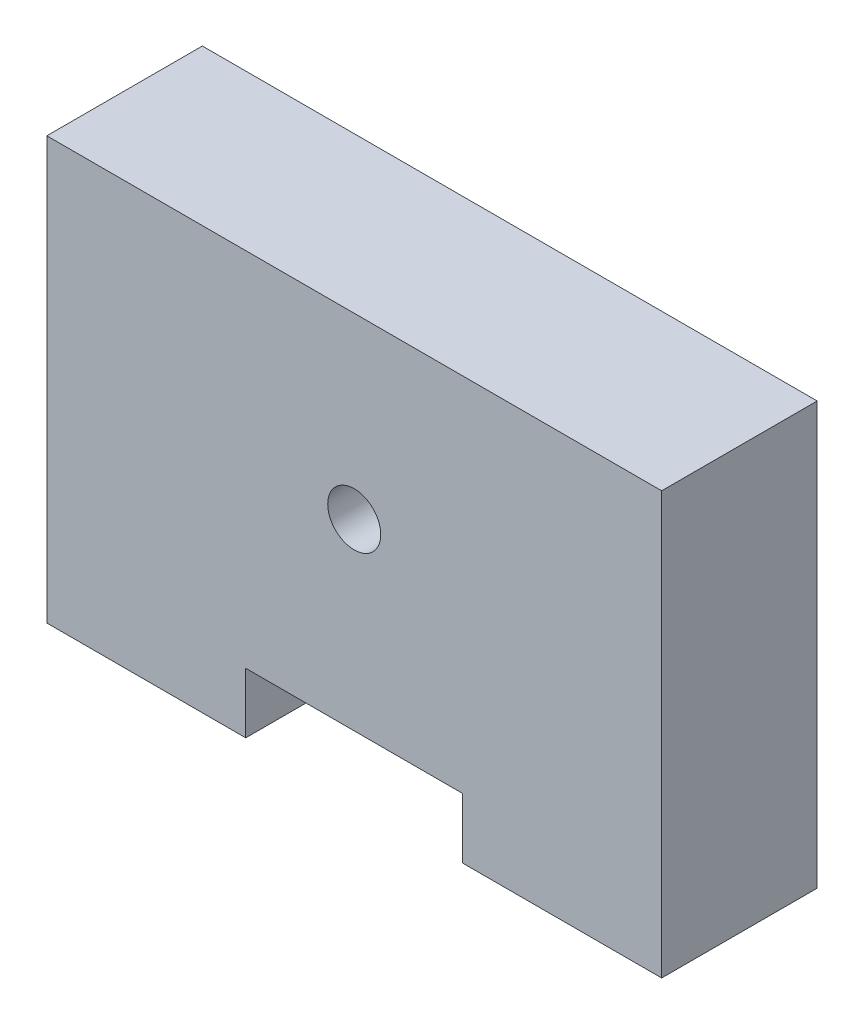
ISO-10303-21;
HEADER;
FILE_DESCRIPTION(('STEP AP214'),'2;1');
FILE_NAME('part.step','',(''),(''),'','','');
FILE_SCHEMA(('AUTOMOTIVE_DESIGN { 1 0 10303 214 1 1 1 1 }'));
ENDSEC;
DATA;
#1=APPLICATION_CONTEXT('core data for automotive mechanical design processes');
#2=APPLICATION_PROTOCOL_DEFINITION('international standard','automotive_design',2000,#1);
#3=PRODUCT_CONTEXT('',#1,'mechanical');
#4=PRODUCT('Part','Part','',(#3));
#5=PRODUCT_RELATED_PRODUCT_CATEGORY('part','',(#4));
#6=PRODUCT_DEFINITION_FORMATION('','',#4);
#7=PRODUCT_DEFINITION_CONTEXT('part definition',#1,'design');
#8=PRODUCT_DEFINITION('design','',#6,#7);
#9=PRODUCT_DEFINITION_SHAPE('','',#8);
#10=(LENGTH_UNIT() NAMED_UNIT(*) SI_UNIT(.MILLI.,.METRE.));
#11=(NAMED_UNIT(*) PLANE_ANGLE_UNIT() SI_UNIT($,.RADIAN.));
#12=(NAMED_UNIT(*) SI_UNIT($,.STERADIAN.) SOLID_ANGLE_UNIT());
#13=UNCERTAINTY_MEASURE_WITH_UNIT(LENGTH_MEASURE(1.E-05),#10,'distance_accuracy_value','');
#14=(GEOMETRIC_REPRESENTATION_CONTEXT(3) GLOBAL_UNCERTAINTY_ASSIGNED_CONTEXT((#13)) GLOBAL_UNIT_ASSIGNED_CONTEXT((#10,
#11,#12)) REPRESENTATION_CONTEXT('',''));
#15=CARTESIAN_POINT('',(0.,0.,0.));
#16=DIRECTION('',(0.,0.,1.));
#17=DIRECTION('',(1.,0.,0.));
#18=AXIS2_PLACEMENT_3D('',#15,#16,#17);
#19=CARTESIAN_POINT('',(0.,0.,0.));
#20=DIRECTION('',(0.,-1.,0.));
#21=DIRECTION('',(0.,0.,-1.));
#22=AXIS2_PLACEMENT_3D('',#19,#20,#21);
#23=PLANE('',#22);
#24=DIRECTION('',(0.,0.,-1.));
#25=VECTOR('',#24,1.);
#26=CARTESIAN_POINT('',(9.,0.,25.1315416922694));
#27=LINE('',#26,#25);
#28=CARTESIAN_POINT('',(9.,0.,6.45));
#29=VERTEX_POINT('',#28);
#30=CARTESIAN_POINT('',(9.,0.,-6.45));
#31=VERTEX_POINT('',#30);
#32=EDGE_CURVE('E128',#29,#31,#27,.T.);
#33=ORIENTED_EDGE('',*,*,#32,.T.);
#34=DIRECTION('',(-1.,0.,0.));
#35=VECTOR('',#34,1.);
#36=CARTESIAN_POINT('',(25.5,0.,-6.45000000000001));
#37=LINE('',#36,#35);
#38=CARTESIAN_POINT('',(25.5,0.,-6.45000000000001));
#39=VERTEX_POINT('',#38);
#40=EDGE_CURVE('E140',#39,#31,#37,.T.);
#41=ORIENTED_EDGE('',*,*,#40,.F.);
#42=DIRECTION('',(0.,0.,-1.));
#43=VECTOR('',#42,1.);
#44=CARTESIAN_POINT('',(25.5,0.,-6.45000000000001));
#45=LINE('',#44,#43);
#46=CARTESIAN_POINT('',(25.5,0.,6.45000000000001));
#47=VERTEX_POINT('',#46);
#48=EDGE_CURVE('E151',#47,#39,#45,.T.);
#49=ORIENTED_EDGE('',*,*,#48,.F.);
#50=DIRECTION('',(1.,0.,0.));
#51=VECTOR('',#50,1.);
#52=CARTESIAN_POINT('',(25.5,0.,6.45000000000001));
#53=LINE('',#52,#51);
#54=EDGE_CURVE('E90',#29,#47,#53,.T.);
#55=ORIENTED_EDGE('',*,*,#54,.F.);
#56=EDGE_LOOP('',(#33,#41,#49,#55));
#57=FACE_BOUND('',#56,.T.);
#58=CARTESIAN_POINT('',(18.75,0.,0.));
#59=DIRECTION('',(0.,-1.,0.));
#60=DIRECTION('',(0.,0.,-1.));
#61=AXIS2_PLACEMENT_3D('',#58,#59,#60);
#62=CIRCLE('',#61,1.25);
#63=CARTESIAN_POINT('',(18.75,0.,-1.25));
#64=VERTEX_POINT('',#63);
#65=EDGE_CURVE('E191',#64,#64,#62,.T.);
#66=ORIENTED_EDGE('',*,*,#65,.F.);
#67=EDGE_LOOP('',(#66));
#68=FACE_BOUND('',#67,.T.);
#69=ADVANCED_FACE('F45',(#57,#68),#23,.T.);
#70=CARTESIAN_POINT('',(25.5,35.,-6.45000000000001));
#71=DIRECTION('',(-1.,0.,0.));
#72=DIRECTION('',(0.,0.,1.));
#73=AXIS2_PLACEMENT_3D('',#70,#71,#72);
#74=PLANE('',#73);
#75=ORIENTED_EDGE('',*,*,#48,.T.);
#76=DIRECTION('',(0.,-1.,0.));
#77=VECTOR('',#76,1.);
#78=CARTESIAN_POINT('',(25.5,35.,-6.45000000000001));
#79=LINE('',#78,#77);
#80=CARTESIAN_POINT('',(25.5,35.,-6.45000000000001));
#81=VERTEX_POINT('',#80);
#82=EDGE_CURVE('E11',#81,#39,#79,.T.);
#83=ORIENTED_EDGE('',*,*,#82,.F.);
#84=DIRECTION('',(0.,0.,-1.));
#85=VECTOR('',#84,1.);
#86=CARTESIAN_POINT('',(25.5,35.,-6.45000000000001));
#87=LINE('',#86,#85);
#88=CARTESIAN_POINT('',(25.5,35.,6.45000000000001));
#89=VERTEX_POINT('',#88);
#90=EDGE_CURVE('E158',#89,#81,#87,.T.);
#91=ORIENTED_EDGE('',*,*,#90,.F.);
#92=DIRECTION('',(0.,-1.,0.));
#93=VECTOR('',#92,1.);
#94=CARTESIAN_POINT('',(25.5,35.,6.45000000000001));
#95=LINE('',#94,#93);
#96=EDGE_CURVE('E159',#89,#47,#95,.T.);
#97=ORIENTED_EDGE('',*,*,#96,.T.);
#98=EDGE_LOOP('',(#75,#83,#91,#97));
#99=FACE_BOUND('',#98,.T.);
#100=ADVANCED_FACE('F47',(#99),#74,.F.);
#101=CARTESIAN_POINT('',(25.5,35.,-6.45000000000001));
#102=DIRECTION('',(0.,0.,1.));
#103=DIRECTION('',(1.,0.,0.));
#104=AXIS2_PLACEMENT_3D('',#101,#102,#103);
#105=PLANE('',#104);
#106=CARTESIAN_POINT('',(0.,20.2,-6.45));
#107=DIRECTION('',(0.,0.,-1.));
#108=DIRECTION('',(-1.,0.,0.));
#109=AXIS2_PLACEMENT_3D('',#106,#107,#108);
#110=CIRCLE('',#109,2.2);
#111=CARTESIAN_POINT('',(-2.2,20.2,-6.45));
#112=VERTEX_POINT('',#111);
#113=EDGE_CURVE('E135',#112,#112,#110,.T.);
#114=ORIENTED_EDGE('',*,*,#113,.F.);
#115=EDGE_LOOP('',(#114));
#116=FACE_BOUND('',#115,.T.);
#117=ORIENTED_EDGE('',*,*,#40,.T.);
#118=DIRECTION('',(0.,-1.,0.));
#119=VECTOR('',#118,1.);
#120=CARTESIAN_POINT('',(9.,0.,-6.45));
#121=LINE('',#120,#119);
#122=CARTESIAN_POINT('',(9.,5.,-6.45));
#123=VERTEX_POINT('',#122);
#124=EDGE_CURVE('E125',#123,#31,#121,.T.);
#125=ORIENTED_EDGE('',*,*,#124,.F.);
#126=DIRECTION('',(1.,0.,0.));
#127=VECTOR('',#126,1.);
#128=CARTESIAN_POINT('',(9.,5.,-6.45));
#129=LINE('',#128,#127);
#130=CARTESIAN_POINT('',(-9.,5.,-6.45));
#131=VERTEX_POINT('',#130);
#132=EDGE_CURVE('E142',#131,#123,#129,.T.);
#133=ORIENTED_EDGE('',*,*,#132,.F.);
#134=DIRECTION('',(0.,1.,0.));
#135=VECTOR('',#134,1.);
#136=CARTESIAN_POINT('',(-9.,0.,-6.45));
#137=LINE('',#136,#135);
#138=CARTESIAN_POINT('',(-9.,0.,-6.45));
#139=VERTEX_POINT('',#138);
#140=EDGE_CURVE('E134',#139,#131,#137,.T.);
#141=ORIENTED_EDGE('',*,*,#140,.F.);
#142=CARTESIAN_POINT('',(-25.5,0.,-6.45));
#143=VERTEX_POINT('',#142);
#144=EDGE_CURVE('E148',#139,#143,#37,.T.);
#145=ORIENTED_EDGE('',*,*,#144,.T.);
#146=DIRECTION('',(0.,-1.,0.));
#147=VECTOR('',#146,1.);
#148=CARTESIAN_POINT('',(-25.5,35.,-6.45));
#149=LINE('',#148,#147);
#150=CARTESIAN_POINT('',(-25.5,35.,-6.45));
#151=VERTEX_POINT('',#150);
#152=EDGE_CURVE('E53',#151,#143,#149,.T.);
#153=ORIENTED_EDGE('',*,*,#152,.F.);
#154=DIRECTION('',(-1.,0.,0.));
#155=VECTOR('',#154,1.);
#156=CARTESIAN_POINT('',(25.5,35.,-6.45000000000001));
#157=LINE('',#156,#155);
#158=EDGE_CURVE('E97',#81,#151,#157,.T.);
#159=ORIENTED_EDGE('',*,*,#158,.F.);
#160=ORIENTED_EDGE('',*,*,#82,.T.);
#161=EDGE_LOOP('',(#117,#125,#133,#141,#145,#153,#159,#160));
#162=FACE_BOUND('',#161,.T.);
#163=ADVANCED_FACE('F144',(#116,#162),#105,.F.);
#164=CARTESIAN_POINT('',(-25.5,35.,-6.45));
#165=DIRECTION('',(1.,0.,0.));
#166=DIRECTION('',(0.,0.,-1.));
#167=AXIS2_PLACEMENT_3D('',#164,#165,#166);
#168=PLANE('',#167);
#169=DIRECTION('',(0.,0.,1.));
#170=VECTOR('',#169,1.);
#171=CARTESIAN_POINT('',(-25.5,0.,-6.45));
#172=LINE('',#171,#170);
#173=CARTESIAN_POINT('',(-25.5,0.,6.45));
#174=VERTEX_POINT('',#173);
#175=EDGE_CURVE('E147',#143,#174,#172,.T.);
#176=ORIENTED_EDGE('',*,*,#175,.T.);
#177=DIRECTION('',(0.,-1.,0.));
#178=VECTOR('',#177,1.);
#179=CARTESIAN_POINT('',(-25.5,35.,6.45));
#180=LINE('',#179,#178);
#181=CARTESIAN_POINT('',(-25.5,35.,6.45));
#182=VERTEX_POINT('',#181);
#183=EDGE_CURVE('E161',#182,#174,#180,.T.);
#184=ORIENTED_EDGE('',*,*,#183,.F.);
#185=DIRECTION('',(0.,0.,1.));
#186=VECTOR('',#185,1.);
#187=CARTESIAN_POINT('',(-25.5,35.,-6.45));
#188=LINE('',#187,#186);
#189=EDGE_CURVE('E169',#151,#182,#188,.T.);
#190=ORIENTED_EDGE('',*,*,#189,.F.);
#191=ORIENTED_EDGE('',*,*,#152,.T.);
#192=EDGE_LOOP('',(#176,#184,#190,#191));
#193=FACE_BOUND('',#192,.T.);
#194=ADVANCED_FACE('F167',(#193),#168,.F.);
#195=CARTESIAN_POINT('',(25.5,35.,6.45000000000001));
#196=DIRECTION('',(0.,0.,-1.));
#197=DIRECTION('',(-1.,0.,0.));
#198=AXIS2_PLACEMENT_3D('',#195,#196,#197);
#199=PLANE('',#198);
#200=CARTESIAN_POINT('',(0.,20.2,6.45));
#201=DIRECTION('',(0.,0.,-1.));
#202=DIRECTION('',(-1.,0.,0.));
#203=AXIS2_PLACEMENT_3D('',#200,#201,#202);
#204=CIRCLE('',#203,2.2);
#205=CARTESIAN_POINT('',(-2.2,20.2,6.45));
#206=VERTEX_POINT('',#205);
#207=EDGE_CURVE('E197',#206,#206,#204,.F.);
#208=ORIENTED_EDGE('',*,*,#207,.F.);
#209=EDGE_LOOP('',(#208));
#210=FACE_BOUND('',#209,.T.);
#211=DIRECTION('',(-1.,0.,0.));
#212=VECTOR('',#211,1.);
#213=CARTESIAN_POINT('',(9.00000000000001,5.,6.45));
#214=LINE('',#213,#212);
#215=CARTESIAN_POINT('',(9.,5.,6.45));
#216=VERTEX_POINT('',#215);
#217=CARTESIAN_POINT('',(-9.,5.,6.45));
#218=VERTEX_POINT('',#217);
#219=EDGE_CURVE('E208',#216,#218,#214,.T.);
#220=ORIENTED_EDGE('',*,*,#219,.F.);
#221=DIRECTION('',(0.,1.,0.));
#222=VECTOR('',#221,1.);
#223=CARTESIAN_POINT('',(9.,0.,6.45));
#224=LINE('',#223,#222);
#225=EDGE_CURVE('E194',#29,#216,#224,.T.);
#226=ORIENTED_EDGE('',*,*,#225,.F.);
#227=ORIENTED_EDGE('',*,*,#54,.T.);
#228=ORIENTED_EDGE('',*,*,#96,.F.);
#229=DIRECTION('',(1.,0.,0.));
#230=VECTOR('',#229,1.);
#231=CARTESIAN_POINT('',(25.5,35.,6.45000000000001));
#232=LINE('',#231,#230);
#233=EDGE_CURVE('E69',#182,#89,#232,.T.);
#234=ORIENTED_EDGE('',*,*,#233,.F.);
#235=ORIENTED_EDGE('',*,*,#183,.T.);
#236=CARTESIAN_POINT('',(-9.,0.,6.45));
#237=VERTEX_POINT('',#236);
#238=EDGE_CURVE('E155',#174,#237,#53,.T.);
#239=ORIENTED_EDGE('',*,*,#238,.T.);
#240=DIRECTION('',(0.,-1.,0.));
#241=VECTOR('',#240,1.);
#242=CARTESIAN_POINT('',(-9.,0.,6.45));
#243=LINE('',#242,#241);
#244=EDGE_CURVE('E60',#218,#237,#243,.T.);
#245=ORIENTED_EDGE('',*,*,#244,.F.);
#246=EDGE_LOOP('',(#220,#226,#227,#228,#234,#235,#239,#245));
#247=FACE_BOUND('',#246,.T.);
#248=ADVANCED_FACE('F176',(#210,#247),#199,.F.);
#249=CARTESIAN_POINT('',(0.,35.,0.));
#250=DIRECTION('',(0.,-1.,0.));
#251=DIRECTION('',(0.,0.,-1.));
#252=AXIS2_PLACEMENT_3D('',#249,#250,#251);
#253=PLANE('',#252);
#254=ORIENTED_EDGE('',*,*,#90,.T.);
#255=ORIENTED_EDGE('',*,*,#158,.T.);
#256=ORIENTED_EDGE('',*,*,#189,.T.);
#257=ORIENTED_EDGE('',*,*,#233,.T.);
#258=EDGE_LOOP('',(#254,#255,#256,#257));
#259=FACE_BOUND('',#258,.T.);
#260=ADVANCED_FACE('F235',(#259),#253,.F.);
#261=DIRECTION('',(0.,0.,-1.));
#262=VECTOR('',#261,1.);
#263=CARTESIAN_POINT('',(-9.,0.,25.1315416922694));
#264=LINE('',#263,#262);
#265=EDGE_CURVE('E141',#237,#139,#264,.T.);
#266=ORIENTED_EDGE('',*,*,#265,.F.);
#267=ORIENTED_EDGE('',*,*,#238,.F.);
#268=ORIENTED_EDGE('',*,*,#175,.F.);
#269=ORIENTED_EDGE('',*,*,#144,.F.);
#270=EDGE_LOOP('',(#266,#267,#268,#269));
#271=FACE_BOUND('',#270,.T.);
#272=CARTESIAN_POINT('',(-18.75,0.,0.));
#273=DIRECTION('',(0.,-1.,0.));
#274=DIRECTION('',(0.,0.,-1.));
#275=AXIS2_PLACEMENT_3D('',#272,#273,#274);
#276=CIRCLE('',#275,1.25);
#277=CARTESIAN_POINT('',(-18.75,0.,-1.25));
#278=VERTEX_POINT('',#277);
#279=EDGE_CURVE('E185',#278,#278,#276,.T.);
#280=ORIENTED_EDGE('',*,*,#279,.F.);
#281=EDGE_LOOP('',(#280));
#282=FACE_BOUND('',#281,.T.);
#283=ADVANCED_FACE('F173',(#271,#282),#23,.T.);
#284=CARTESIAN_POINT('',(-18.75,16.,0.));
#285=DIRECTION('',(0.,-1.,0.));
#286=DIRECTION('',(0.,0.,-1.));
#287=AXIS2_PLACEMENT_3D('',#284,#285,#286);
#288=CONICAL_SURFACE('',#287,1.25,1.02974425867665);
#289=CARTESIAN_POINT('',(-18.75,16.7510757737845,0.));
#290=VERTEX_POINT('',#289);
#291=VERTEX_LOOP('',#290);
#292=FACE_BOUND('',#291,.T.);
#293=CARTESIAN_POINT('',(-18.75,16.,0.));
#294=DIRECTION('',(0.,-1.,0.));
#295=DIRECTION('',(0.,0.,-1.));
#296=AXIS2_PLACEMENT_3D('',#293,#294,#295);
#297=CIRCLE('',#296,1.25);
#298=CARTESIAN_POINT('',(-18.75,16.,-1.25));
#299=VERTEX_POINT('',#298);
#300=EDGE_CURVE('E182',#299,#299,#297,.T.);
#301=ORIENTED_EDGE('',*,*,#300,.T.);
#302=EDGE_LOOP('',(#301));
#303=FACE_BOUND('',#302,.T.);
#304=ADVANCED_FACE('F234',(#292,#303),#288,.F.);
#305=CARTESIAN_POINT('',(-18.75,0.,0.));
#306=DIRECTION('',(0.,-1.,0.));
#307=DIRECTION('',(0.,0.,-1.));
#308=AXIS2_PLACEMENT_3D('',#305,#306,#307);
#309=CYLINDRICAL_SURFACE('',#308,1.25);
#310=ORIENTED_EDGE('',*,*,#300,.F.);
#311=EDGE_LOOP('',(#310));
#312=FACE_BOUND('',#311,.T.);
#313=ORIENTED_EDGE('',*,*,#279,.T.);
#314=EDGE_LOOP('',(#313));
#315=FACE_BOUND('',#314,.T.);
#316=ADVANCED_FACE('F240',(#312,#315),#309,.F.);
#317=CARTESIAN_POINT('',(18.75,16.,0.));
#318=DIRECTION('',(0.,-1.,0.));
#319=DIRECTION('',(0.,0.,-1.));
#320=AXIS2_PLACEMENT_3D('',#317,#318,#319);
#321=CONICAL_SURFACE('',#320,1.25,1.02974425867665);
#322=CARTESIAN_POINT('',(18.75,16.7510757737845,0.));
#323=VERTEX_POINT('',#322);
#324=VERTEX_LOOP('',#323);
#325=FACE_BOUND('',#324,.T.);
#326=CARTESIAN_POINT('',(18.75,16.,0.));
#327=DIRECTION('',(0.,-1.,0.));
#328=DIRECTION('',(0.,0.,-1.));
#329=AXIS2_PLACEMENT_3D('',#326,#327,#328);
#330=CIRCLE('',#329,1.25);
#331=CARTESIAN_POINT('',(18.75,16.,-1.25));
#332=VERTEX_POINT('',#331);
#333=EDGE_CURVE('E188',#332,#332,#330,.T.);
#334=ORIENTED_EDGE('',*,*,#333,.T.);
#335=EDGE_LOOP('',(#334));
#336=FACE_BOUND('',#335,.T.);
#337=ADVANCED_FACE('F250',(#325,#336),#321,.F.);
#338=CARTESIAN_POINT('',(18.75,0.,0.));
#339=DIRECTION('',(0.,-1.,0.));
#340=DIRECTION('',(0.,0.,-1.));
#341=AXIS2_PLACEMENT_3D('',#338,#339,#340);
#342=CYLINDRICAL_SURFACE('',#341,1.25);
#343=ORIENTED_EDGE('',*,*,#333,.F.);
#344=EDGE_LOOP('',(#343));
#345=FACE_BOUND('',#344,.T.);
#346=ORIENTED_EDGE('',*,*,#65,.T.);
#347=EDGE_LOOP('',(#346));
#348=FACE_BOUND('',#347,.T.);
#349=ADVANCED_FACE('F254',(#345,#348),#342,.F.);
#350=CARTESIAN_POINT('',(9.,0.,25.1315416922694));
#351=DIRECTION('',(1.,0.,0.));
#352=DIRECTION('',(0.,0.,-1.));
#353=AXIS2_PLACEMENT_3D('',#350,#351,#352);
#354=PLANE('',#353);
#355=ORIENTED_EDGE('',*,*,#225,.T.);
#356=DIRECTION('',(0.,0.,-1.));
#357=VECTOR('',#356,1.);
#358=CARTESIAN_POINT('',(9.,5.,25.1315416922694));
#359=LINE('',#358,#357);
#360=EDGE_CURVE('E130',#216,#123,#359,.T.);
#361=ORIENTED_EDGE('',*,*,#360,.T.);
#362=ORIENTED_EDGE('',*,*,#124,.T.);
#363=ORIENTED_EDGE('',*,*,#32,.F.);
#364=EDGE_LOOP('',(#355,#361,#362,#363));
#365=FACE_BOUND('',#364,.T.);
#366=ADVANCED_FACE('F127',(#365),#354,.F.);
#367=CARTESIAN_POINT('',(9.,5.,25.1315416922694));
#368=DIRECTION('',(0.,1.,0.));
#369=DIRECTION('',(0.,0.,1.));
#370=AXIS2_PLACEMENT_3D('',#367,#368,#369);
#371=PLANE('',#370);
#372=ORIENTED_EDGE('',*,*,#219,.T.);
#373=DIRECTION('',(0.,0.,-1.));
#374=VECTOR('',#373,1.);
#375=CARTESIAN_POINT('',(-9.,5.,25.1315416922694));
#376=LINE('',#375,#374);
#377=EDGE_CURVE('E201',#218,#131,#376,.T.);
#378=ORIENTED_EDGE('',*,*,#377,.T.);
#379=ORIENTED_EDGE('',*,*,#132,.T.);
#380=ORIENTED_EDGE('',*,*,#360,.F.);
#381=EDGE_LOOP('',(#372,#378,#379,#380));
#382=FACE_BOUND('',#381,.T.);
#383=ADVANCED_FACE('F211',(#382),#371,.F.);
#384=CARTESIAN_POINT('',(-9.,0.,25.1315416922694));
#385=DIRECTION('',(-1.,0.,0.));
#386=DIRECTION('',(0.,0.,1.));
#387=AXIS2_PLACEMENT_3D('',#384,#385,#386);
#388=PLANE('',#387);
#389=ORIENTED_EDGE('',*,*,#244,.T.);
#390=ORIENTED_EDGE('',*,*,#265,.T.);
#391=ORIENTED_EDGE('',*,*,#140,.T.);
#392=ORIENTED_EDGE('',*,*,#377,.F.);
#393=EDGE_LOOP('',(#389,#390,#391,#392));
#394=FACE_BOUND('',#393,.T.);
#395=ADVANCED_FACE('F212',(#394),#388,.F.);
#396=CARTESIAN_POINT('',(0.,20.2,25.1315416922694));
#397=DIRECTION('',(0.,0.,-1.));
#398=DIRECTION('',(-1.,0.,0.));
#399=AXIS2_PLACEMENT_3D('',#396,#397,#398);
#400=CYLINDRICAL_SURFACE('',#399,2.2);
#401=ORIENTED_EDGE('',*,*,#207,.T.);
#402=EDGE_LOOP('',(#401));
#403=FACE_BOUND('',#402,.T.);
#404=ORIENTED_EDGE('',*,*,#113,.T.);
#405=EDGE_LOOP('',(#404));
#406=FACE_BOUND('',#405,.T.);
#407=ADVANCED_FACE('F215',(#403,#406),#400,.F.);
#408=CLOSED_SHELL('',(#69,#100,#163,#194,#248,#260,#283,#304,#316,#337,#349,#366,#383,#395,#407));
#409=MANIFOLD_SOLID_BREP('B2',#408);
#410=ADVANCED_BREP_SHAPE_REPRESENTATION('',(#18,#409),#14);
#411=SHAPE_DEFINITION_REPRESENTATION(#9,#410);
ENDSEC;
END-ISO-10303-21;
